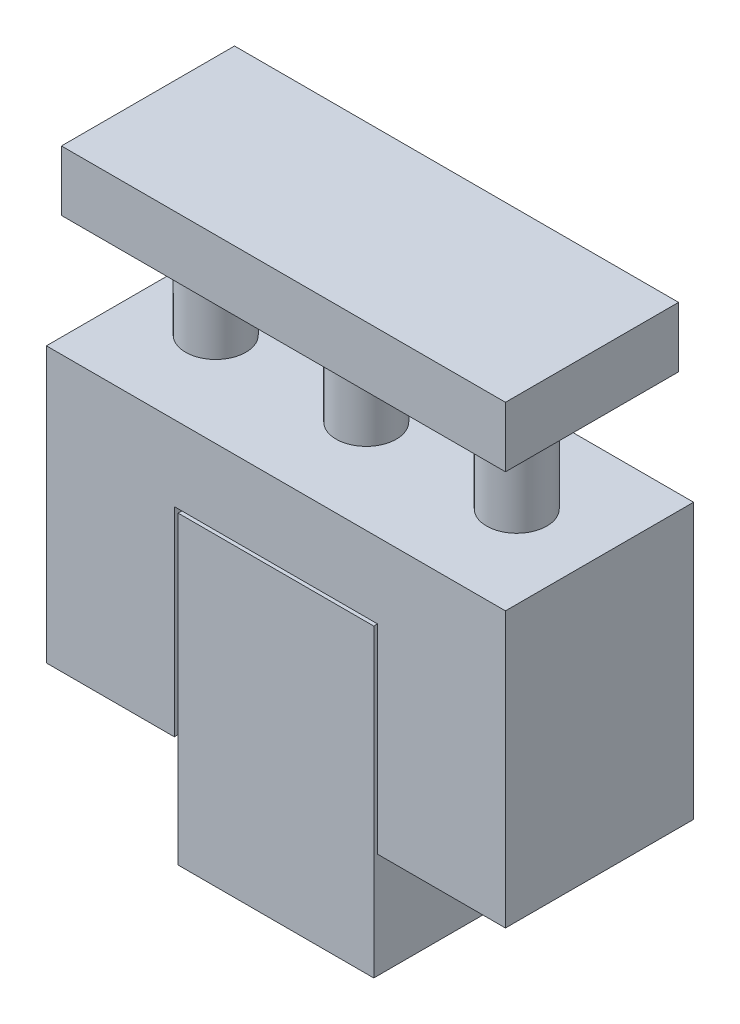
ISO-10303-21;
HEADER;
FILE_DESCRIPTION(('STEP AP214'),'2;1');
FILE_NAME('part.step','',(''),(''),'','','');
FILE_SCHEMA(('AUTOMOTIVE_DESIGN { 1 0 10303 214 1 1 1 1 }'));
ENDSEC;
DATA;
#1=APPLICATION_CONTEXT('core data for automotive mechanical design processes');
#2=APPLICATION_PROTOCOL_DEFINITION('international standard','automotive_design',2000,#1);
#3=PRODUCT_CONTEXT('',#1,'mechanical');
#4=PRODUCT('Part','Part','',(#3));
#5=PRODUCT_RELATED_PRODUCT_CATEGORY('part','',(#4));
#6=PRODUCT_DEFINITION_FORMATION('','',#4);
#7=PRODUCT_DEFINITION_CONTEXT('part definition',#1,'design');
#8=PRODUCT_DEFINITION('design','',#6,#7);
#9=PRODUCT_DEFINITION_SHAPE('','',#8);
#10=(LENGTH_UNIT() NAMED_UNIT(*) SI_UNIT(.MILLI.,.METRE.));
#11=(NAMED_UNIT(*) PLANE_ANGLE_UNIT() SI_UNIT($,.RADIAN.));
#12=(NAMED_UNIT(*) SI_UNIT($,.STERADIAN.) SOLID_ANGLE_UNIT());
#13=UNCERTAINTY_MEASURE_WITH_UNIT(LENGTH_MEASURE(1.E-05),#10,'distance_accuracy_value','');
#14=(GEOMETRIC_REPRESENTATION_CONTEXT(3) GLOBAL_UNCERTAINTY_ASSIGNED_CONTEXT((#13)) GLOBAL_UNIT_ASSIGNED_CONTEXT((#10,
#11,#12)) REPRESENTATION_CONTEXT('',''));
#15=CARTESIAN_POINT('',(0.,0.,0.));
#16=DIRECTION('',(0.,0.,1.));
#17=DIRECTION('',(1.,0.,0.));
#18=AXIS2_PLACEMENT_3D('',#15,#16,#17);
#19=CARTESIAN_POINT('',(-61.,-11.5,0.));
#20=DIRECTION('',(-1.,0.,0.));
#21=DIRECTION('',(0.,0.,1.));
#22=AXIS2_PLACEMENT_3D('',#19,#20,#21);
#23=PLANE('',#22);
#24=DIRECTION('',(0.,-1.,0.));
#25=VECTOR('',#24,1.);
#26=CARTESIAN_POINT('',(-61.,-11.5,50.));
#27=LINE('',#26,#25);
#28=CARTESIAN_POINT('',(-61.,61.5,50.));
#29=VERTEX_POINT('',#28);
#30=CARTESIAN_POINT('',(-61.,-11.5,50.));
#31=VERTEX_POINT('',#30);
#32=EDGE_CURVE('E156',#29,#31,#27,.T.);
#33=ORIENTED_EDGE('',*,*,#32,.F.);
#34=DIRECTION('',(0.,0.,1.));
#35=VECTOR('',#34,1.);
#36=CARTESIAN_POINT('',(-61.,61.5,0.));
#37=LINE('',#36,#35);
#38=CARTESIAN_POINT('',(-61.,61.5,0.));
#39=VERTEX_POINT('',#38);
#40=EDGE_CURVE('E12',#39,#29,#37,.T.);
#41=ORIENTED_EDGE('',*,*,#40,.F.);
#42=DIRECTION('',(0.,-1.,0.));
#43=VECTOR('',#42,1.);
#44=CARTESIAN_POINT('',(-61.,-11.5,0.));
#45=LINE('',#44,#43);
#46=CARTESIAN_POINT('',(-61.,-11.5,0.));
#47=VERTEX_POINT('',#46);
#48=EDGE_CURVE('E185',#39,#47,#45,.T.);
#49=ORIENTED_EDGE('',*,*,#48,.T.);
#50=DIRECTION('',(0.,0.,1.));
#51=VECTOR('',#50,1.);
#52=CARTESIAN_POINT('',(-61.,-11.5,0.));
#53=LINE('',#52,#51);
#54=EDGE_CURVE('E52',#47,#31,#53,.T.);
#55=ORIENTED_EDGE('',*,*,#54,.T.);
#56=EDGE_LOOP('',(#33,#41,#49,#55));
#57=FACE_BOUND('',#56,.T.);
#58=ADVANCED_FACE('F49',(#57),#23,.T.);
#59=CARTESIAN_POINT('',(-61.,61.5,0.));
#60=DIRECTION('',(0.,1.,0.));
#61=DIRECTION('',(-1.,0.,0.));
#62=AXIS2_PLACEMENT_3D('',#59,#60,#61);
#63=PLANE('',#62);
#64=CARTESIAN_POINT('',(39.,61.5,25.));
#65=DIRECTION('',(0.,1.,0.));
#66=DIRECTION('',(-1.,0.,0.));
#67=AXIS2_PLACEMENT_3D('',#64,#65,#66);
#68=CIRCLE('',#67,8.);
#69=CARTESIAN_POINT('',(31.,61.5,25.));
#70=VERTEX_POINT('',#69);
#71=EDGE_CURVE('E303',#70,#70,#68,.T.);
#72=ORIENTED_EDGE('',*,*,#71,.F.);
#73=EDGE_LOOP('',(#72));
#74=FACE_BOUND('',#73,.T.);
#75=CARTESIAN_POINT('',(-0.999999999999987,61.5,25.));
#76=DIRECTION('',(0.,1.,0.));
#77=DIRECTION('',(-1.,0.,0.));
#78=AXIS2_PLACEMENT_3D('',#75,#76,#77);
#79=CIRCLE('',#78,8.);
#80=CARTESIAN_POINT('',(-8.99999999999999,61.5,25.));
#81=VERTEX_POINT('',#80);
#82=EDGE_CURVE('E318',#81,#81,#79,.T.);
#83=ORIENTED_EDGE('',*,*,#82,.F.);
#84=EDGE_LOOP('',(#83));
#85=FACE_BOUND('',#84,.T.);
#86=CARTESIAN_POINT('',(-41.,61.5,25.));
#87=DIRECTION('',(0.,1.,0.));
#88=DIRECTION('',(-1.,0.,0.));
#89=AXIS2_PLACEMENT_3D('',#86,#87,#88);
#90=CIRCLE('',#89,8.);
#91=CARTESIAN_POINT('',(-49.,61.5,25.));
#92=VERTEX_POINT('',#91);
#93=EDGE_CURVE('E324',#92,#92,#90,.T.);
#94=ORIENTED_EDGE('',*,*,#93,.F.);
#95=EDGE_LOOP('',(#94));
#96=FACE_BOUND('',#95,.T.);
#97=DIRECTION('',(-1.,0.,0.));
#98=VECTOR('',#97,1.);
#99=CARTESIAN_POINT('',(-61.,61.5,50.));
#100=LINE('',#99,#98);
#101=CARTESIAN_POINT('',(61.,61.5,50.));
#102=VERTEX_POINT('',#101);
#103=EDGE_CURVE('E182',#102,#29,#100,.T.);
#104=ORIENTED_EDGE('',*,*,#103,.F.);
#105=DIRECTION('',(0.,0.,1.));
#106=VECTOR('',#105,1.);
#107=CARTESIAN_POINT('',(61.,61.5,0.));
#108=LINE('',#107,#106);
#109=CARTESIAN_POINT('',(61.,61.5,0.));
#110=VERTEX_POINT('',#109);
#111=EDGE_CURVE('E59',#110,#102,#108,.T.);
#112=ORIENTED_EDGE('',*,*,#111,.F.);
#113=DIRECTION('',(-1.,0.,0.));
#114=VECTOR('',#113,1.);
#115=CARTESIAN_POINT('',(-61.,61.5,0.));
#116=LINE('',#115,#114);
#117=EDGE_CURVE('E142',#110,#39,#116,.T.);
#118=ORIENTED_EDGE('',*,*,#117,.T.);
#119=ORIENTED_EDGE('',*,*,#40,.T.);
#120=EDGE_LOOP('',(#104,#112,#118,#119));
#121=FACE_BOUND('',#120,.T.);
#122=ADVANCED_FACE('F203',(#74,#85,#96,#121),#63,.T.);
#123=CARTESIAN_POINT('',(61.,-11.5,0.));
#124=DIRECTION('',(1.,0.,0.));
#125=DIRECTION('',(0.,1.,0.));
#126=AXIS2_PLACEMENT_3D('',#123,#124,#125);
#127=PLANE('',#126);
#128=DIRECTION('',(0.,1.,0.));
#129=VECTOR('',#128,1.);
#130=CARTESIAN_POINT('',(61.,-11.5,50.));
#131=LINE('',#130,#129);
#132=CARTESIAN_POINT('',(61.,-11.5,50.));
#133=VERTEX_POINT('',#132);
#134=EDGE_CURVE('E128',#133,#102,#131,.T.);
#135=ORIENTED_EDGE('',*,*,#134,.F.);
#136=DIRECTION('',(0.,0.,1.));
#137=VECTOR('',#136,1.);
#138=CARTESIAN_POINT('',(61.,-11.5,0.));
#139=LINE('',#138,#137);
#140=CARTESIAN_POINT('',(61.,-11.5,0.));
#141=VERTEX_POINT('',#140);
#142=EDGE_CURVE('E123',#141,#133,#139,.T.);
#143=ORIENTED_EDGE('',*,*,#142,.F.);
#144=DIRECTION('',(0.,1.,0.));
#145=VECTOR('',#144,1.);
#146=CARTESIAN_POINT('',(61.,-11.5,0.));
#147=LINE('',#146,#145);
#148=EDGE_CURVE('E126',#141,#110,#147,.T.);
#149=ORIENTED_EDGE('',*,*,#148,.T.);
#150=ORIENTED_EDGE('',*,*,#111,.T.);
#151=EDGE_LOOP('',(#135,#143,#149,#150));
#152=FACE_BOUND('',#151,.T.);
#153=ADVANCED_FACE('F125',(#152),#127,.T.);
#154=CARTESIAN_POINT('',(61.,-11.5,0.));
#155=DIRECTION('',(0.,-1.,0.));
#156=DIRECTION('',(1.,0.,0.));
#157=AXIS2_PLACEMENT_3D('',#154,#155,#156);
#158=PLANE('',#157);
#159=DIRECTION('',(1.,0.,0.));
#160=VECTOR('',#159,1.);
#161=CARTESIAN_POINT('',(61.,-11.5,50.));
#162=LINE('',#161,#160);
#163=CARTESIAN_POINT('',(27.,-11.5,50.));
#164=VERTEX_POINT('',#163);
#165=EDGE_CURVE('E177',#164,#133,#162,.T.);
#166=ORIENTED_EDGE('',*,*,#165,.F.);
#167=DIRECTION('',(0.,0.,1.));
#168=VECTOR('',#167,1.);
#169=CARTESIAN_POINT('',(27.,-11.5,0.));
#170=LINE('',#169,#168);
#171=CARTESIAN_POINT('',(27.,-11.5,0.));
#172=VERTEX_POINT('',#171);
#173=EDGE_CURVE('E134',#172,#164,#170,.T.);
#174=ORIENTED_EDGE('',*,*,#173,.F.);
#175=DIRECTION('',(1.,0.,0.));
#176=VECTOR('',#175,1.);
#177=CARTESIAN_POINT('',(61.,-11.5,0.));
#178=LINE('',#177,#176);
#179=EDGE_CURVE('E140',#172,#141,#178,.T.);
#180=ORIENTED_EDGE('',*,*,#179,.T.);
#181=ORIENTED_EDGE('',*,*,#142,.T.);
#182=EDGE_LOOP('',(#166,#174,#180,#181));
#183=FACE_BOUND('',#182,.T.);
#184=ADVANCED_FACE('F145',(#183),#158,.T.);
#185=CARTESIAN_POINT('',(27.,41.5,0.));
#186=DIRECTION('',(-1.,0.,0.));
#187=DIRECTION('',(0.,-1.,0.));
#188=AXIS2_PLACEMENT_3D('',#185,#186,#187);
#189=PLANE('',#188);
#190=DIRECTION('',(0.,-1.,0.));
#191=VECTOR('',#190,1.);
#192=CARTESIAN_POINT('',(27.,41.5,50.));
#193=LINE('',#192,#191);
#194=CARTESIAN_POINT('',(27.,41.5,50.));
#195=VERTEX_POINT('',#194);
#196=EDGE_CURVE('E173',#195,#164,#193,.T.);
#197=ORIENTED_EDGE('',*,*,#196,.F.);
#198=DIRECTION('',(0.,0.,1.));
#199=VECTOR('',#198,1.);
#200=CARTESIAN_POINT('',(27.,41.5,0.));
#201=LINE('',#200,#199);
#202=CARTESIAN_POINT('',(27.,41.5,0.));
#203=VERTEX_POINT('',#202);
#204=EDGE_CURVE('E191',#203,#195,#201,.T.);
#205=ORIENTED_EDGE('',*,*,#204,.F.);
#206=DIRECTION('',(0.,-1.,0.));
#207=VECTOR('',#206,1.);
#208=CARTESIAN_POINT('',(27.,41.5,0.));
#209=LINE('',#208,#207);
#210=EDGE_CURVE('E147',#203,#172,#209,.T.);
#211=ORIENTED_EDGE('',*,*,#210,.T.);
#212=ORIENTED_EDGE('',*,*,#173,.T.);
#213=EDGE_LOOP('',(#197,#205,#211,#212));
#214=FACE_BOUND('',#213,.T.);
#215=ADVANCED_FACE('F219',(#214),#189,.T.);
#216=CARTESIAN_POINT('',(27.,41.5,0.));
#217=DIRECTION('',(0.,-1.,0.));
#218=DIRECTION('',(1.,0.,0.));
#219=AXIS2_PLACEMENT_3D('',#216,#217,#218);
#220=PLANE('',#219);
#221=DIRECTION('',(1.,0.,0.));
#222=VECTOR('',#221,1.);
#223=CARTESIAN_POINT('',(27.,41.5,50.));
#224=LINE('',#223,#222);
#225=CARTESIAN_POINT('',(-27.,41.5,50.));
#226=VERTEX_POINT('',#225);
#227=EDGE_CURVE('E169',#226,#195,#224,.T.);
#228=ORIENTED_EDGE('',*,*,#227,.F.);
#229=DIRECTION('',(0.,0.,1.));
#230=VECTOR('',#229,1.);
#231=CARTESIAN_POINT('',(-27.,41.5,0.));
#232=LINE('',#231,#230);
#233=CARTESIAN_POINT('',(-27.,41.5,0.));
#234=VERTEX_POINT('',#233);
#235=EDGE_CURVE('E194',#234,#226,#232,.T.);
#236=ORIENTED_EDGE('',*,*,#235,.F.);
#237=DIRECTION('',(1.,0.,0.));
#238=VECTOR('',#237,1.);
#239=CARTESIAN_POINT('',(27.,41.5,0.));
#240=LINE('',#239,#238);
#241=EDGE_CURVE('E150',#234,#203,#240,.T.);
#242=ORIENTED_EDGE('',*,*,#241,.T.);
#243=ORIENTED_EDGE('',*,*,#204,.T.);
#244=EDGE_LOOP('',(#228,#236,#242,#243));
#245=FACE_BOUND('',#244,.T.);
#246=ADVANCED_FACE('F222',(#245),#220,.T.);
#247=CARTESIAN_POINT('',(-27.,41.5,0.));
#248=DIRECTION('',(1.,0.,0.));
#249=DIRECTION('',(0.,1.,0.));
#250=AXIS2_PLACEMENT_3D('',#247,#248,#249);
#251=PLANE('',#250);
#252=DIRECTION('',(0.,1.,0.));
#253=VECTOR('',#252,1.);
#254=CARTESIAN_POINT('',(-27.,41.5,50.));
#255=LINE('',#254,#253);
#256=CARTESIAN_POINT('',(-27.,-11.5,50.));
#257=VERTEX_POINT('',#256);
#258=EDGE_CURVE('E165',#257,#226,#255,.T.);
#259=ORIENTED_EDGE('',*,*,#258,.F.);
#260=DIRECTION('',(0.,0.,1.));
#261=VECTOR('',#260,1.);
#262=CARTESIAN_POINT('',(-27.,-11.5,0.));
#263=LINE('',#262,#261);
#264=CARTESIAN_POINT('',(-27.,-11.5,0.));
#265=VERTEX_POINT('',#264);
#266=EDGE_CURVE('E196',#265,#257,#263,.T.);
#267=ORIENTED_EDGE('',*,*,#266,.F.);
#268=DIRECTION('',(0.,1.,0.));
#269=VECTOR('',#268,1.);
#270=CARTESIAN_POINT('',(-27.,41.5,0.));
#271=LINE('',#270,#269);
#272=EDGE_CURVE('E339',#265,#234,#271,.T.);
#273=ORIENTED_EDGE('',*,*,#272,.T.);
#274=ORIENTED_EDGE('',*,*,#235,.T.);
#275=EDGE_LOOP('',(#259,#267,#273,#274));
#276=FACE_BOUND('',#275,.T.);
#277=ADVANCED_FACE('F226',(#276),#251,.T.);
#278=CARTESIAN_POINT('',(-61.,-11.5,0.));
#279=DIRECTION('',(0.,-1.,0.));
#280=DIRECTION('',(0.,0.,-1.));
#281=AXIS2_PLACEMENT_3D('',#278,#279,#280);
#282=PLANE('',#281);
#283=DIRECTION('',(1.,0.,0.));
#284=VECTOR('',#283,1.);
#285=CARTESIAN_POINT('',(-61.,-11.5,50.));
#286=LINE('',#285,#284);
#287=EDGE_CURVE('E160',#31,#257,#286,.T.);
#288=ORIENTED_EDGE('',*,*,#287,.F.);
#289=ORIENTED_EDGE('',*,*,#54,.F.);
#290=DIRECTION('',(1.,0.,0.));
#291=VECTOR('',#290,1.);
#292=CARTESIAN_POINT('',(-61.,-11.5,0.));
#293=LINE('',#292,#291);
#294=EDGE_CURVE('E336',#47,#265,#293,.T.);
#295=ORIENTED_EDGE('',*,*,#294,.T.);
#296=ORIENTED_EDGE('',*,*,#266,.T.);
#297=EDGE_LOOP('',(#288,#289,#295,#296));
#298=FACE_BOUND('',#297,.T.);
#299=ADVANCED_FACE('F200',(#298),#282,.T.);
#300=CARTESIAN_POINT('',(0.,0.,0.));
#301=DIRECTION('',(0.,0.,-1.));
#302=DIRECTION('',(-1.,0.,0.));
#303=AXIS2_PLACEMENT_3D('',#300,#301,#302);
#304=PLANE('',#303);
#305=ORIENTED_EDGE('',*,*,#48,.F.);
#306=ORIENTED_EDGE('',*,*,#117,.F.);
#307=ORIENTED_EDGE('',*,*,#148,.F.);
#308=ORIENTED_EDGE('',*,*,#179,.F.);
#309=ORIENTED_EDGE('',*,*,#210,.F.);
#310=ORIENTED_EDGE('',*,*,#241,.F.);
#311=ORIENTED_EDGE('',*,*,#272,.F.);
#312=ORIENTED_EDGE('',*,*,#294,.F.);
#313=EDGE_LOOP('',(#305,#306,#307,#308,#309,#310,#311,#312));
#314=FACE_BOUND('',#313,.T.);
#315=ADVANCED_FACE('F138',(#314),#304,.T.);
#316=CARTESIAN_POINT('',(0.,0.,50.));
#317=DIRECTION('',(0.,0.,-1.));
#318=DIRECTION('',(-1.,0.,0.));
#319=AXIS2_PLACEMENT_3D('',#316,#317,#318);
#320=PLANE('',#319);
#321=ORIENTED_EDGE('',*,*,#32,.T.);
#322=ORIENTED_EDGE('',*,*,#287,.T.);
#323=ORIENTED_EDGE('',*,*,#258,.T.);
#324=ORIENTED_EDGE('',*,*,#227,.T.);
#325=ORIENTED_EDGE('',*,*,#196,.T.);
#326=ORIENTED_EDGE('',*,*,#165,.T.);
#327=ORIENTED_EDGE('',*,*,#134,.T.);
#328=ORIENTED_EDGE('',*,*,#103,.T.);
#329=EDGE_LOOP('',(#321,#322,#323,#324,#325,#326,#327,#328));
#330=FACE_BOUND('',#329,.T.);
#331=ADVANCED_FACE('F202',(#330),#320,.F.);
#332=CARTESIAN_POINT('',(-41.,91.5,25.));
#333=DIRECTION('',(0.,-1.,0.));
#334=DIRECTION('',(1.,0.,0.));
#335=AXIS2_PLACEMENT_3D('',#332,#333,#334);
#336=CYLINDRICAL_SURFACE('',#335,8.);
#337=CARTESIAN_POINT('',(-41.,91.5,25.));
#338=DIRECTION('',(0.,1.,0.));
#339=DIRECTION('',(-1.,0.,0.));
#340=AXIS2_PLACEMENT_3D('',#337,#338,#339);
#341=CIRCLE('',#340,8.);
#342=CARTESIAN_POINT('',(-49.,91.5,25.));
#343=VERTEX_POINT('',#342);
#344=EDGE_CURVE('E161',#343,#343,#341,.T.);
#345=ORIENTED_EDGE('',*,*,#344,.F.);
#346=EDGE_LOOP('',(#345));
#347=FACE_BOUND('',#346,.T.);
#348=ORIENTED_EDGE('',*,*,#93,.T.);
#349=EDGE_LOOP('',(#348));
#350=FACE_BOUND('',#349,.T.);
#351=ADVANCED_FACE('F237',(#347,#350),#336,.T.);
#352=CARTESIAN_POINT('',(-0.99999999999999,91.5,25.));
#353=DIRECTION('',(0.,-1.,0.));
#354=DIRECTION('',(1.,0.,0.));
#355=AXIS2_PLACEMENT_3D('',#352,#353,#354);
#356=CYLINDRICAL_SURFACE('',#355,8.);
#357=CARTESIAN_POINT('',(-0.99999999999999,91.5,25.));
#358=DIRECTION('',(0.,1.,0.));
#359=DIRECTION('',(-1.,0.,0.));
#360=AXIS2_PLACEMENT_3D('',#357,#358,#359);
#361=CIRCLE('',#360,8.);
#362=CARTESIAN_POINT('',(-8.99999999999999,91.5,25.));
#363=VERTEX_POINT('',#362);
#364=EDGE_CURVE('E320',#363,#363,#361,.T.);
#365=ORIENTED_EDGE('',*,*,#364,.F.);
#366=EDGE_LOOP('',(#365));
#367=FACE_BOUND('',#366,.T.);
#368=ORIENTED_EDGE('',*,*,#82,.T.);
#369=EDGE_LOOP('',(#368));
#370=FACE_BOUND('',#369,.T.);
#371=ADVANCED_FACE('F241',(#367,#370),#356,.T.);
#372=CARTESIAN_POINT('',(39.,91.5,25.));
#373=DIRECTION('',(0.,-1.,0.));
#374=DIRECTION('',(1.,0.,0.));
#375=AXIS2_PLACEMENT_3D('',#372,#373,#374);
#376=CYLINDRICAL_SURFACE('',#375,8.);
#377=CARTESIAN_POINT('',(39.,91.5,25.));
#378=DIRECTION('',(0.,1.,0.));
#379=DIRECTION('',(-1.,0.,0.));
#380=AXIS2_PLACEMENT_3D('',#377,#378,#379);
#381=CIRCLE('',#380,8.);
#382=CARTESIAN_POINT('',(31.,91.5,25.));
#383=VERTEX_POINT('',#382);
#384=EDGE_CURVE('E309',#383,#383,#381,.T.);
#385=ORIENTED_EDGE('',*,*,#384,.F.);
#386=EDGE_LOOP('',(#385));
#387=FACE_BOUND('',#386,.T.);
#388=ORIENTED_EDGE('',*,*,#71,.T.);
#389=EDGE_LOOP('',(#388));
#390=FACE_BOUND('',#389,.T.);
#391=ADVANCED_FACE('F245',(#387,#390),#376,.T.);
#392=CARTESIAN_POINT('',(-59.,107.5,2.));
#393=DIRECTION('',(1.,0.,0.));
#394=DIRECTION('',(0.,1.,0.));
#395=AXIS2_PLACEMENT_3D('',#392,#393,#394);
#396=PLANE('',#395);
#397=DIRECTION('',(0.,0.,1.));
#398=VECTOR('',#397,1.);
#399=CARTESIAN_POINT('',(-59.,91.5,2.));
#400=LINE('',#399,#398);
#401=CARTESIAN_POINT('',(-59.,91.5,2.));
#402=VERTEX_POINT('',#401);
#403=CARTESIAN_POINT('',(-59.,91.5,48.));
#404=VERTEX_POINT('',#403);
#405=EDGE_CURVE('E300',#402,#404,#400,.T.);
#406=ORIENTED_EDGE('',*,*,#405,.T.);
#407=DIRECTION('',(0.,-1.,0.));
#408=VECTOR('',#407,1.);
#409=CARTESIAN_POINT('',(-59.,107.5,48.));
#410=LINE('',#409,#408);
#411=CARTESIAN_POINT('',(-59.,107.5,48.));
#412=VERTEX_POINT('',#411);
#413=EDGE_CURVE('E297',#412,#404,#410,.T.);
#414=ORIENTED_EDGE('',*,*,#413,.F.);
#415=DIRECTION('',(0.,0.,1.));
#416=VECTOR('',#415,1.);
#417=CARTESIAN_POINT('',(-59.,107.5,2.));
#418=LINE('',#417,#416);
#419=CARTESIAN_POINT('',(-59.,107.5,2.));
#420=VERTEX_POINT('',#419);
#421=EDGE_CURVE('E280',#420,#412,#418,.T.);
#422=ORIENTED_EDGE('',*,*,#421,.F.);
#423=DIRECTION('',(0.,-1.,0.));
#424=VECTOR('',#423,1.);
#425=CARTESIAN_POINT('',(-59.,107.5,2.));
#426=LINE('',#425,#424);
#427=EDGE_CURVE('E376',#420,#402,#426,.T.);
#428=ORIENTED_EDGE('',*,*,#427,.T.);
#429=EDGE_LOOP('',(#406,#414,#422,#428));
#430=FACE_BOUND('',#429,.T.);
#431=ADVANCED_FACE('F249',(#430),#396,.F.);
#432=CARTESIAN_POINT('',(-59.,107.5,48.));
#433=DIRECTION('',(0.,0.,-1.));
#434=DIRECTION('',(-1.,0.,0.));
#435=AXIS2_PLACEMENT_3D('',#432,#433,#434);
#436=PLANE('',#435);
#437=DIRECTION('',(1.,0.,0.));
#438=VECTOR('',#437,1.);
#439=CARTESIAN_POINT('',(-59.,91.5,48.));
#440=LINE('',#439,#438);
#441=CARTESIAN_POINT('',(59.,91.5,48.));
#442=VERTEX_POINT('',#441);
#443=EDGE_CURVE('E362',#404,#442,#440,.T.);
#444=ORIENTED_EDGE('',*,*,#443,.T.);
#445=DIRECTION('',(0.,-1.,0.));
#446=VECTOR('',#445,1.);
#447=CARTESIAN_POINT('',(59.,107.5,48.));
#448=LINE('',#447,#446);
#449=CARTESIAN_POINT('',(59.,107.5,48.));
#450=VERTEX_POINT('',#449);
#451=EDGE_CURVE('E304',#450,#442,#448,.T.);
#452=ORIENTED_EDGE('',*,*,#451,.F.);
#453=DIRECTION('',(1.,0.,0.));
#454=VECTOR('',#453,1.);
#455=CARTESIAN_POINT('',(-59.,107.5,48.));
#456=LINE('',#455,#454);
#457=EDGE_CURVE('E285',#412,#450,#456,.T.);
#458=ORIENTED_EDGE('',*,*,#457,.F.);
#459=ORIENTED_EDGE('',*,*,#413,.T.);
#460=EDGE_LOOP('',(#444,#452,#458,#459));
#461=FACE_BOUND('',#460,.T.);
#462=ADVANCED_FACE('F253',(#461),#436,.F.);
#463=CARTESIAN_POINT('',(59.,107.5,1.99999999999999));
#464=DIRECTION('',(-1.,0.,0.));
#465=DIRECTION('',(0.,-1.,0.));
#466=AXIS2_PLACEMENT_3D('',#463,#464,#465);
#467=PLANE('',#466);
#468=DIRECTION('',(0.,0.,-1.));
#469=VECTOR('',#468,1.);
#470=CARTESIAN_POINT('',(59.,91.5,1.99999999999999));
#471=LINE('',#470,#469);
#472=CARTESIAN_POINT('',(59.,91.5,1.99999999999999));
#473=VERTEX_POINT('',#472);
#474=EDGE_CURVE('E366',#442,#473,#471,.T.);
#475=ORIENTED_EDGE('',*,*,#474,.T.);
#476=DIRECTION('',(0.,-1.,0.));
#477=VECTOR('',#476,1.);
#478=CARTESIAN_POINT('',(59.,107.5,1.99999999999999));
#479=LINE('',#478,#477);
#480=CARTESIAN_POINT('',(59.,107.5,1.99999999999999));
#481=VERTEX_POINT('',#480);
#482=EDGE_CURVE('E312',#481,#473,#479,.T.);
#483=ORIENTED_EDGE('',*,*,#482,.F.);
#484=DIRECTION('',(0.,0.,-1.));
#485=VECTOR('',#484,1.);
#486=CARTESIAN_POINT('',(59.,107.5,1.99999999999999));
#487=LINE('',#486,#485);
#488=EDGE_CURVE('E384',#450,#481,#487,.T.);
#489=ORIENTED_EDGE('',*,*,#488,.F.);
#490=ORIENTED_EDGE('',*,*,#451,.T.);
#491=EDGE_LOOP('',(#475,#483,#489,#490));
#492=FACE_BOUND('',#491,.T.);
#493=ADVANCED_FACE('F257',(#492),#467,.F.);
#494=CARTESIAN_POINT('',(-59.,107.5,2.));
#495=DIRECTION('',(0.,0.,1.));
#496=DIRECTION('',(1.,0.,0.));
#497=AXIS2_PLACEMENT_3D('',#494,#495,#496);
#498=PLANE('',#497);
#499=DIRECTION('',(-1.,0.,0.));
#500=VECTOR('',#499,1.);
#501=CARTESIAN_POINT('',(-59.,91.5,2.));
#502=LINE('',#501,#500);
#503=EDGE_CURVE('E293',#473,#402,#502,.T.);
#504=ORIENTED_EDGE('',*,*,#503,.T.);
#505=ORIENTED_EDGE('',*,*,#427,.F.);
#506=DIRECTION('',(-1.,0.,0.));
#507=VECTOR('',#506,1.);
#508=CARTESIAN_POINT('',(-59.,107.5,2.));
#509=LINE('',#508,#507);
#510=EDGE_CURVE('E288',#481,#420,#509,.T.);
#511=ORIENTED_EDGE('',*,*,#510,.F.);
#512=ORIENTED_EDGE('',*,*,#482,.T.);
#513=EDGE_LOOP('',(#504,#505,#511,#512));
#514=FACE_BOUND('',#513,.T.);
#515=ADVANCED_FACE('F261',(#514),#498,.F.);
#516=CARTESIAN_POINT('',(0.,107.5,0.));
#517=DIRECTION('',(0.,1.,0.));
#518=DIRECTION('',(0.,0.,1.));
#519=AXIS2_PLACEMENT_3D('',#516,#517,#518);
#520=PLANE('',#519);
#521=ORIENTED_EDGE('',*,*,#421,.T.);
#522=ORIENTED_EDGE('',*,*,#457,.T.);
#523=ORIENTED_EDGE('',*,*,#488,.T.);
#524=ORIENTED_EDGE('',*,*,#510,.T.);
#525=EDGE_LOOP('',(#521,#522,#523,#524));
#526=FACE_BOUND('',#525,.T.);
#527=ADVANCED_FACE('F265',(#526),#520,.T.);
#528=CARTESIAN_POINT('',(0.,91.5,0.));
#529=DIRECTION('',(0.,1.,0.));
#530=DIRECTION('',(0.,0.,1.));
#531=AXIS2_PLACEMENT_3D('',#528,#529,#530);
#532=PLANE('',#531);
#533=ORIENTED_EDGE('',*,*,#344,.T.);
#534=EDGE_LOOP('',(#533));
#535=FACE_BOUND('',#534,.T.);
#536=ORIENTED_EDGE('',*,*,#364,.T.);
#537=EDGE_LOOP('',(#536));
#538=FACE_BOUND('',#537,.T.);
#539=ORIENTED_EDGE('',*,*,#384,.T.);
#540=EDGE_LOOP('',(#539));
#541=FACE_BOUND('',#540,.T.);
#542=ORIENTED_EDGE('',*,*,#405,.F.);
#543=ORIENTED_EDGE('',*,*,#503,.F.);
#544=ORIENTED_EDGE('',*,*,#474,.F.);
#545=ORIENTED_EDGE('',*,*,#443,.F.);
#546=EDGE_LOOP('',(#542,#543,#544,#545));
#547=FACE_BOUND('',#546,.T.);
#548=ADVANCED_FACE('F267',(#535,#538,#541,#547),#532,.F.);
#549=CLOSED_SHELL('',(#58,#122,#153,#184,#215,#246,#277,#299,#315,#331,#351,#371,#391,#431,#462,
#493,#515,#527,#548));
#550=MANIFOLD_SOLID_BREP('B2',#549);
#551=CARTESIAN_POINT('',(26.,40.5,50.));
#552=DIRECTION('',(-1.,0.,0.));
#553=DIRECTION('',(0.,-1.,0.));
#554=AXIS2_PLACEMENT_3D('',#551,#552,#553);
#555=PLANE('',#554);
#556=DIRECTION('',(0.,1.,0.));
#557=VECTOR('',#556,1.);
#558=CARTESIAN_POINT('',(26.,40.5,0.));
#559=LINE('',#558,#557);
#560=CARTESIAN_POINT('',(26.,-40.5,0.));
#561=VERTEX_POINT('',#560);
#562=CARTESIAN_POINT('',(26.,40.5,0.));
#563=VERTEX_POINT('',#562);
#564=EDGE_CURVE('E569',#561,#563,#559,.T.);
#565=ORIENTED_EDGE('',*,*,#564,.T.);
#566=DIRECTION('',(0.,0.,-1.));
#567=VECTOR('',#566,1.);
#568=CARTESIAN_POINT('',(26.,40.5,50.));
#569=LINE('',#568,#567);
#570=CARTESIAN_POINT('',(26.,40.5,50.));
#571=VERTEX_POINT('',#570);
#572=EDGE_CURVE('E47',#571,#563,#569,.T.);
#573=ORIENTED_EDGE('',*,*,#572,.F.);
#574=DIRECTION('',(0.,1.,0.));
#575=VECTOR('',#574,1.);
#576=CARTESIAN_POINT('',(26.,40.5,50.));
#577=LINE('',#576,#575);
#578=CARTESIAN_POINT('',(26.,-40.5,50.));
#579=VERTEX_POINT('',#578);
#580=EDGE_CURVE('E557',#579,#571,#577,.T.);
#581=ORIENTED_EDGE('',*,*,#580,.F.);
#582=DIRECTION('',(0.,0.,-1.));
#583=VECTOR('',#582,1.);
#584=CARTESIAN_POINT('',(26.,-40.5,50.));
#585=LINE('',#584,#583);
#586=EDGE_CURVE('E565',#579,#561,#585,.T.);
#587=ORIENTED_EDGE('',*,*,#586,.T.);
#588=EDGE_LOOP('',(#565,#573,#581,#587));
#589=FACE_BOUND('',#588,.T.);
#590=ADVANCED_FACE('F506',(#589),#555,.F.);
#591=CARTESIAN_POINT('',(-26.,40.5,50.));
#592=DIRECTION('',(0.,-1.,0.));
#593=DIRECTION('',(0.,0.,-1.));
#594=AXIS2_PLACEMENT_3D('',#591,#592,#593);
#595=PLANE('',#594);
#596=DIRECTION('',(-1.,0.,0.));
#597=VECTOR('',#596,1.);
#598=CARTESIAN_POINT('',(-26.,40.5,0.));
#599=LINE('',#598,#597);
#600=CARTESIAN_POINT('',(-26.,40.5,0.));
#601=VERTEX_POINT('',#600);
#602=EDGE_CURVE('E561',#563,#601,#599,.T.);
#603=ORIENTED_EDGE('',*,*,#602,.T.);
#604=DIRECTION('',(0.,0.,-1.));
#605=VECTOR('',#604,1.);
#606=CARTESIAN_POINT('',(-26.,40.5,50.));
#607=LINE('',#606,#605);
#608=CARTESIAN_POINT('',(-26.,40.5,50.));
#609=VERTEX_POINT('',#608);
#610=EDGE_CURVE('E514',#609,#601,#607,.T.);
#611=ORIENTED_EDGE('',*,*,#610,.F.);
#612=DIRECTION('',(-1.,0.,0.));
#613=VECTOR('',#612,1.);
#614=CARTESIAN_POINT('',(-26.,40.5,50.));
#615=LINE('',#614,#613);
#616=EDGE_CURVE('E552',#571,#609,#615,.T.);
#617=ORIENTED_EDGE('',*,*,#616,.F.);
#618=ORIENTED_EDGE('',*,*,#572,.T.);
#619=EDGE_LOOP('',(#603,#611,#617,#618));
#620=FACE_BOUND('',#619,.T.);
#621=ADVANCED_FACE('F560',(#620),#595,.F.);
#622=CARTESIAN_POINT('',(-26.,40.5,50.));
#623=DIRECTION('',(1.,0.,0.));
#624=DIRECTION('',(0.,1.,0.));
#625=AXIS2_PLACEMENT_3D('',#622,#623,#624);
#626=PLANE('',#625);
#627=DIRECTION('',(0.,-1.,0.));
#628=VECTOR('',#627,1.);
#629=CARTESIAN_POINT('',(-26.,40.5,0.));
#630=LINE('',#629,#628);
#631=CARTESIAN_POINT('',(-26.,-40.5,0.));
#632=VERTEX_POINT('',#631);
#633=EDGE_CURVE('E539',#601,#632,#630,.T.);
#634=ORIENTED_EDGE('',*,*,#633,.T.);
#635=DIRECTION('',(0.,0.,-1.));
#636=VECTOR('',#635,1.);
#637=CARTESIAN_POINT('',(-26.,-40.5,50.));
#638=LINE('',#637,#636);
#639=CARTESIAN_POINT('',(-26.,-40.5,50.));
#640=VERTEX_POINT('',#639);
#641=EDGE_CURVE('E562',#640,#632,#638,.T.);
#642=ORIENTED_EDGE('',*,*,#641,.F.);
#643=DIRECTION('',(0.,-1.,0.));
#644=VECTOR('',#643,1.);
#645=CARTESIAN_POINT('',(-26.,40.5,50.));
#646=LINE('',#645,#644);
#647=EDGE_CURVE('E555',#609,#640,#646,.T.);
#648=ORIENTED_EDGE('',*,*,#647,.F.);
#649=ORIENTED_EDGE('',*,*,#610,.T.);
#650=EDGE_LOOP('',(#634,#642,#648,#649));
#651=FACE_BOUND('',#650,.T.);
#652=ADVANCED_FACE('F563',(#651),#626,.F.);
#653=CARTESIAN_POINT('',(-26.,-40.5,50.));
#654=DIRECTION('',(0.,1.,0.));
#655=DIRECTION('',(0.,0.,1.));
#656=AXIS2_PLACEMENT_3D('',#653,#654,#655);
#657=PLANE('',#656);
#658=DIRECTION('',(1.,0.,0.));
#659=VECTOR('',#658,1.);
#660=CARTESIAN_POINT('',(-26.,-40.5,0.));
#661=LINE('',#660,#659);
#662=EDGE_CURVE('E545',#632,#561,#661,.T.);
#663=ORIENTED_EDGE('',*,*,#662,.T.);
#664=ORIENTED_EDGE('',*,*,#586,.F.);
#665=DIRECTION('',(1.,0.,0.));
#666=VECTOR('',#665,1.);
#667=CARTESIAN_POINT('',(-26.,-40.5,50.));
#668=LINE('',#667,#666);
#669=EDGE_CURVE('E522',#640,#579,#668,.T.);
#670=ORIENTED_EDGE('',*,*,#669,.F.);
#671=ORIENTED_EDGE('',*,*,#641,.T.);
#672=EDGE_LOOP('',(#663,#664,#670,#671));
#673=FACE_BOUND('',#672,.T.);
#674=ADVANCED_FACE('F576',(#673),#657,.F.);
#675=CARTESIAN_POINT('',(0.,0.,50.));
#676=DIRECTION('',(0.,0.,1.));
#677=DIRECTION('',(1.,0.,0.));
#678=AXIS2_PLACEMENT_3D('',#675,#676,#677);
#679=PLANE('',#678);
#680=ORIENTED_EDGE('',*,*,#580,.T.);
#681=ORIENTED_EDGE('',*,*,#616,.T.);
#682=ORIENTED_EDGE('',*,*,#647,.T.);
#683=ORIENTED_EDGE('',*,*,#669,.T.);
#684=EDGE_LOOP('',(#680,#681,#682,#683));
#685=FACE_BOUND('',#684,.T.);
#686=ADVANCED_FACE('F553',(#685),#679,.T.);
#687=CARTESIAN_POINT('',(0.,0.,0.));
#688=DIRECTION('',(0.,0.,1.));
#689=DIRECTION('',(1.,0.,0.));
#690=AXIS2_PLACEMENT_3D('',#687,#688,#689);
#691=PLANE('',#690);
#692=ORIENTED_EDGE('',*,*,#564,.F.);
#693=ORIENTED_EDGE('',*,*,#662,.F.);
#694=ORIENTED_EDGE('',*,*,#633,.F.);
#695=ORIENTED_EDGE('',*,*,#602,.F.);
#696=EDGE_LOOP('',(#692,#693,#694,#695));
#697=FACE_BOUND('',#696,.T.);
#698=ADVANCED_FACE('F579',(#697),#691,.F.);
#699=CLOSED_SHELL('',(#590,#621,#652,#674,#686,#698));
#700=MANIFOLD_SOLID_BREP('B6',#699);
#701=ADVANCED_BREP_SHAPE_REPRESENTATION('',(#18,#550,#700),#14);
#702=SHAPE_DEFINITION_REPRESENTATION(#9,#701);
ENDSEC;
END-ISO-10303-21;
